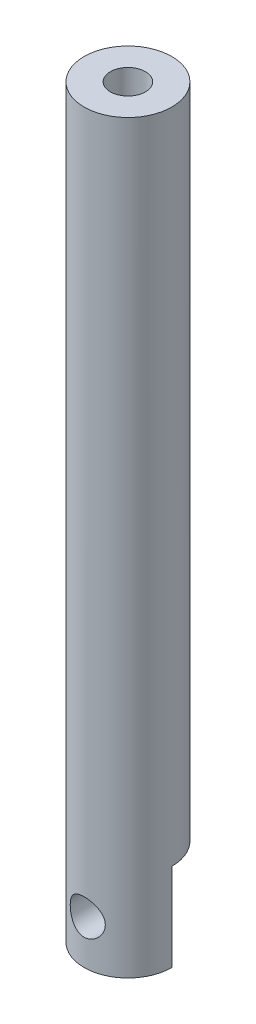
ISO-10303-21;
HEADER;
FILE_DESCRIPTION(('STEP AP214'),'2;1');
FILE_NAME('part.step','',(''),(''),'','','');
FILE_SCHEMA(('AUTOMOTIVE_DESIGN { 1 0 10303 214 1 1 1 1 }'));
ENDSEC;
DATA;
#1=APPLICATION_CONTEXT('core data for automotive mechanical design processes');
#2=APPLICATION_PROTOCOL_DEFINITION('international standard','automotive_design',2000,#1);
#3=PRODUCT_CONTEXT('',#1,'mechanical');
#4=PRODUCT('Part','Part','',(#3));
#5=PRODUCT_RELATED_PRODUCT_CATEGORY('part','',(#4));
#6=PRODUCT_DEFINITION_FORMATION('','',#4);
#7=PRODUCT_DEFINITION_CONTEXT('part definition',#1,'design');
#8=PRODUCT_DEFINITION('design','',#6,#7);
#9=PRODUCT_DEFINITION_SHAPE('','',#8);
#10=(LENGTH_UNIT() NAMED_UNIT(*) SI_UNIT(.MILLI.,.METRE.));
#11=(NAMED_UNIT(*) PLANE_ANGLE_UNIT() SI_UNIT($,.RADIAN.));
#12=(NAMED_UNIT(*) SI_UNIT($,.STERADIAN.) SOLID_ANGLE_UNIT());
#13=UNCERTAINTY_MEASURE_WITH_UNIT(LENGTH_MEASURE(1.E-05),#10,'distance_accuracy_value','');
#14=(GEOMETRIC_REPRESENTATION_CONTEXT(3) GLOBAL_UNCERTAINTY_ASSIGNED_CONTEXT((#13)) GLOBAL_UNIT_ASSIGNED_CONTEXT((#10,
#11,#12)) REPRESENTATION_CONTEXT('',''));
#15=CARTESIAN_POINT('',(0.,0.,0.));
#16=DIRECTION('',(0.,0.,1.));
#17=DIRECTION('',(1.,0.,0.));
#18=AXIS2_PLACEMENT_3D('',#15,#16,#17);
#19=CARTESIAN_POINT('',(0.,85.,0.));
#20=DIRECTION('',(0.,-1.,0.));
#21=DIRECTION('',(0.,0.,-1.));
#22=AXIS2_PLACEMENT_3D('',#19,#20,#21);
#23=CYLINDRICAL_SURFACE('',#22,5.);
#24=CARTESIAN_POINT('',(0.,3.,5.));
#25=CARTESIAN_POINT('',(-0.107493005442891,3.00000985182373,4.99999271227084));
#26=CARTESIAN_POINT('',(-0.215172564090673,3.00871775208838,4.99649294306932));
#27=CARTESIAN_POINT('',(-0.427496480417896,3.04324770352124,4.98283453100641));
#28=CARTESIAN_POINT('',(-0.532131777561248,3.06911627908613,4.97265778698877));
#29=CARTESIAN_POINT('',(-0.734953922727403,3.13687607805883,4.94674209213118));
#30=CARTESIAN_POINT('',(-0.833160661616958,3.17871484621673,4.93102136364072));
#31=CARTESIAN_POINT('',(-1.02107197032837,3.27701917332655,4.89556610796078));
#32=CARTESIAN_POINT('',(-1.11077947675099,3.33347965491893,4.87583297458056));
#33=CARTESIAN_POINT('',(-1.28350100757039,3.46223549856094,4.83330886170418));
#34=CARTESIAN_POINT('',(-1.36606227255021,3.53510665624026,4.8104229692919));
#35=CARTESIAN_POINT('',(-1.51817500478472,3.69340000347678,4.76460576906194));
#36=CARTESIAN_POINT('',(-1.58772010713353,3.77882829721174,4.74167444453792));
#37=CARTESIAN_POINT('',(-1.71487456729288,3.96442807024227,4.69722791797136));
#38=CARTESIAN_POINT('',(-1.77181498119547,4.0650864860232,4.67582115964951));
#39=CARTESIAN_POINT('',(-1.86775471903715,4.27553639842004,4.63833647186792));
#40=CARTESIAN_POINT('',(-1.90676256428583,4.38532352784836,4.62225601244176));
#41=CARTESIAN_POINT('',(-1.96389882339587,4.6057123335921,4.59826357660818));
#42=CARTESIAN_POINT('',(-1.98289396580565,4.71605123557621,4.59001420355605));
#43=CARTESIAN_POINT('',(-2.00217296164003,4.93863499830727,4.58164004049144));
#44=CARTESIAN_POINT('',(-2.00246601631322,5.05087889462501,4.58151125522768));
#45=CARTESIAN_POINT('',(-1.98498936750454,5.26575667145804,4.58910500279994));
#46=CARTESIAN_POINT('',(-1.96847531430514,5.36851571440903,4.5962817503845));
#47=CARTESIAN_POINT('',(-1.91994688029782,5.56965955600671,4.61676187607836));
#48=CARTESIAN_POINT('',(-1.88792979480463,5.66804358811031,4.63006632321673));
#49=CARTESIAN_POINT('',(-1.80869473255107,5.86001783619604,4.6615948508853));
#50=CARTESIAN_POINT('',(-1.76117986231532,5.95346923905469,4.67991379280787));
#51=CARTESIAN_POINT('',(-1.65250646073221,6.13141581636156,4.7193811638989));
#52=CARTESIAN_POINT('',(-1.59134280510084,6.21590760940281,4.74053065456848));
#53=CARTESIAN_POINT('',(-1.45155059945443,6.380409728802,4.7852673674227));
#54=CARTESIAN_POINT('',(-1.37193746297064,6.45956872944601,4.80891664976151));
#55=CARTESIAN_POINT('',(-1.20031442743019,6.60368447800204,4.85459824958282));
#56=CARTESIAN_POINT('',(-1.10830206533443,6.66863839741029,4.87663024445324));
#57=CARTESIAN_POINT('',(-0.912077652605843,6.78361744741583,4.91714681264548));
#58=CARTESIAN_POINT('',(-0.807660491346478,6.83332228119705,4.93555270095414));
#59=CARTESIAN_POINT('',(-0.591023765482882,6.91416786107806,4.96614828328759));
#60=CARTESIAN_POINT('',(-0.478808196849674,6.94531803755741,4.97834113462382));
#61=CARTESIAN_POINT('',(-0.25689588760782,6.9864482954197,4.9945613950691));
#62=CARTESIAN_POINT('',(-0.147443293985535,6.99757245425356,4.99902945833514));
#63=CARTESIAN_POINT('',(0.071845309807817,7.00171310052861,5.00068478510631));
#64=CARTESIAN_POINT('',(0.181681213223923,6.99473428154751,4.99787393582291));
#65=CARTESIAN_POINT('',(0.393432739121987,6.96370824744801,4.98557567063753));
#66=CARTESIAN_POINT('',(0.495482491775474,6.94044201964903,4.97639391345523));
#67=CARTESIAN_POINT('',(0.69413542806078,6.87856429169019,4.952594414055));
#68=CARTESIAN_POINT('',(0.790737910224844,6.83995082033132,4.9379759735653));
#69=CARTESIAN_POINT('',(0.979078785816702,6.74721506032005,4.90416594770811));
#70=CARTESIAN_POINT('',(1.07057802275541,6.69265452795685,4.88484815979803));
#71=CARTESIAN_POINT('',(1.24344359124655,6.57005967609436,4.84373364745524));
#72=CARTESIAN_POINT('',(1.32480584076112,6.50201995707739,4.8219359311027));
#73=CARTESIAN_POINT('',(1.48072304302882,6.34912998705037,4.77645117638111));
#74=CARTESIAN_POINT('',(1.55447393380606,6.26346645849379,4.75273441425052));
#75=CARTESIAN_POINT('',(1.68675119741371,6.08055991699063,4.70741672917132));
#76=CARTESIAN_POINT('',(1.74527506133751,5.98331499966005,4.68581615526511));
#77=CARTESIAN_POINT('',(1.84580750193163,5.77853830540589,4.64714299907708));
#78=CARTESIAN_POINT('',(1.88765059453445,5.67091600078769,4.63011630884788));
#79=CARTESIAN_POINT('',(1.9522962197053,5.44926634828485,4.60323673477931));
#80=CARTESIAN_POINT('',(1.97511280526932,5.33524379418758,4.59337855695998));
#81=CARTESIAN_POINT('',(1.9997156172784,5.11287209822546,4.58271759299926));
#82=CARTESIAN_POINT('',(2.00289708230287,5.00470516040665,4.58131421008171));
#83=CARTESIAN_POINT('',(1.99180315927752,4.78945514228671,4.58614836033098));
#84=CARTESIAN_POINT('',(1.97752998791378,4.68237192609742,4.59238492324793));
#85=CARTESIAN_POINT('',(1.93307136615365,4.47666781014496,4.6112664907902));
#86=CARTESIAN_POINT('',(1.90353749357098,4.377879725567,4.62364831827449));
#87=CARTESIAN_POINT('',(1.83000544849101,4.18662137038652,4.65324001232696));
#88=CARTESIAN_POINT('',(1.78600328139381,4.09415285310017,4.67045121206006));
#89=CARTESIAN_POINT('',(1.68187276275973,3.91239038072922,4.70898609604491));
#90=CARTESIAN_POINT('',(1.62096533515949,3.82358132986952,4.73048882313242));
#91=CARTESIAN_POINT('',(1.4858921192715,3.65700668279625,4.77463804372237));
#92=CARTESIAN_POINT('',(1.41172233481812,3.57924442787169,4.79728488048406));
#93=CARTESIAN_POINT('',(1.24650550627246,3.43179714673639,4.84293567087394));
#94=CARTESIAN_POINT('',(1.15467600114614,3.36296269310193,4.86586757962185));
#95=CARTESIAN_POINT('',(0.959900320285779,3.24166295737836,4.90800406713717));
#96=CARTESIAN_POINT('',(0.856949004547237,3.18920528784747,4.92720691092906));
#97=CARTESIAN_POINT('',(0.644738062495204,3.10337778480971,4.95939714815861));
#98=CARTESIAN_POINT('',(0.535631618219697,3.06967067643966,4.97249363055028));
#99=CARTESIAN_POINT('',(0.312876546281222,3.02136087904573,4.99144306209365));
#100=CARTESIAN_POINT('',(0.199243525858913,3.0066975632561,4.99731899495637));
#101=CARTESIAN_POINT('',(0.0569122978909298,3.00060461902173,4.99975899504136));
#102=CARTESIAN_POINT('',(0.0284626887407584,2.99999739137081,5.00000192969175));
#103=CARTESIAN_POINT('',(0.,3.,5.));
#104=B_SPLINE_CURVE_WITH_KNOTS('',3,(#24,#25,#26,#27,#28,#29,#30,#31,#32,#33,#34,#35,#36,#37,
#38,#39,#40,#41,#42,#43,#44,#45,#46,#47,#48,#49,#50,#51,#52,#53,#54,#55,#56,#57,#58,#59,#60,#61,
#62,#63,#64,#65,#66,#67,#68,#69,#70,#71,#72,#73,#74,#75,#76,#77,#78,#79,#80,#81,#82,#83,#84,#85,
#86,#87,#88,#89,#90,#91,#92,#93,#94,#95,#96,#97,#98,#99,#100,#101,#102,#103),.UNSPECIFIED.,.T.,
.F.,(4,2,2,2,2,2,2,2,2,2,2,2,2,2,2,2,2,2,2,2,2,2,2,2,2,2,2,2,2,2,2,2,2,2,2,2,2,2,2,4),(0.,
0.322402987893071,0.645683636007934,0.967911457471581,1.29002753567984,1.62597381700397,
1.96208394934411,2.31315258819217,2.66405423118268,2.99904105308828,3.33386306340488,
3.64538328401372,3.95695787256047,4.27489126298816,4.59294421938183,4.93558349186557,
5.27829092839732,5.62776913162806,5.9770695611379,6.30569184528007,6.63422893570082,
6.94800455564365,7.26182048993796,7.58523513398262,7.90877959498969,8.25368474624413,
8.59864669043748,8.94695045140827,9.29499672645933,9.61799673392748,9.94095572563045,
10.2511431854877,10.5614163580516,10.8894546805669,11.2175920134839,11.5670042353384,
11.9165786364053,12.2596430101332,12.6016125240434,12.686980458968),.UNSPECIFIED.);
#105=CARTESIAN_POINT('',(0.,3.,5.));
#106=VERTEX_POINT('',#105);
#107=EDGE_CURVE('E72',#106,#106,#104,.T.);
#108=ORIENTED_EDGE('',*,*,#107,.T.);
#109=EDGE_LOOP('',(#108));
#110=FACE_BOUND('',#109,.T.);
#111=CARTESIAN_POINT('',(0.,85.,0.));
#112=DIRECTION('',(0.,1.,0.));
#113=DIRECTION('',(0.,0.,1.));
#114=AXIS2_PLACEMENT_3D('',#111,#112,#113);
#115=CIRCLE('',#114,5.);
#116=CARTESIAN_POINT('',(0.,85.,5.));
#117=VERTEX_POINT('',#116);
#118=EDGE_CURVE('E11',#117,#117,#115,.T.);
#119=ORIENTED_EDGE('',*,*,#118,.F.);
#120=EDGE_LOOP('',(#119));
#121=FACE_BOUND('',#120,.T.);
#122=CARTESIAN_POINT('',(0.,10.,0.));
#123=DIRECTION('',(0.,-1.,0.));
#124=DIRECTION('',(0.,0.,1.));
#125=AXIS2_PLACEMENT_3D('',#122,#123,#124);
#126=CIRCLE('',#125,5.);
#127=CARTESIAN_POINT('',(-5.,10.,0.));
#128=VERTEX_POINT('',#127);
#129=CARTESIAN_POINT('',(5.,10.,0.));
#130=VERTEX_POINT('',#129);
#131=EDGE_CURVE('E71',#128,#130,#126,.T.);
#132=ORIENTED_EDGE('',*,*,#131,.F.);
#133=DIRECTION('',(0.,-1.,0.));
#134=VECTOR('',#133,1.);
#135=CARTESIAN_POINT('',(-5.,10.,0.));
#136=LINE('',#135,#134);
#137=CARTESIAN_POINT('',(-5.,0.,0.));
#138=VERTEX_POINT('',#137);
#139=EDGE_CURVE('E60',#128,#138,#136,.T.);
#140=ORIENTED_EDGE('',*,*,#139,.T.);
#141=CARTESIAN_POINT('',(0.,0.,0.));
#142=DIRECTION('',(0.,1.,0.));
#143=DIRECTION('',(0.,0.,1.));
#144=AXIS2_PLACEMENT_3D('',#141,#142,#143);
#145=CIRCLE('',#144,5.);
#146=CARTESIAN_POINT('',(5.,0.,0.));
#147=VERTEX_POINT('',#146);
#148=EDGE_CURVE('E42',#138,#147,#145,.T.);
#149=ORIENTED_EDGE('',*,*,#148,.T.);
#150=DIRECTION('',(0.,-1.,0.));
#151=VECTOR('',#150,1.);
#152=CARTESIAN_POINT('',(5.,10.,0.));
#153=LINE('',#152,#151);
#154=EDGE_CURVE('E54',#130,#147,#153,.T.);
#155=ORIENTED_EDGE('',*,*,#154,.F.);
#156=EDGE_LOOP('',(#132,#140,#149,#155));
#157=FACE_BOUND('',#156,.T.);
#158=ADVANCED_FACE('F38',(#110,#121,#157),#23,.T.);
#159=CARTESIAN_POINT('',(0.,85.,0.));
#160=DIRECTION('',(0.,1.,0.));
#161=DIRECTION('',(0.,0.,1.));
#162=AXIS2_PLACEMENT_3D('',#159,#160,#161);
#163=PLANE('',#162);
#164=CARTESIAN_POINT('',(0.,85.,0.));
#165=DIRECTION('',(0.,1.,0.));
#166=DIRECTION('',(0.,0.,1.));
#167=AXIS2_PLACEMENT_3D('',#164,#165,#166);
#168=CIRCLE('',#167,2.);
#169=CARTESIAN_POINT('',(0.,85.,2.));
#170=VERTEX_POINT('',#169);
#171=EDGE_CURVE('E77',#170,#170,#168,.T.);
#172=ORIENTED_EDGE('',*,*,#171,.F.);
#173=EDGE_LOOP('',(#172));
#174=FACE_BOUND('',#173,.T.);
#175=ORIENTED_EDGE('',*,*,#118,.T.);
#176=EDGE_LOOP('',(#175));
#177=FACE_BOUND('',#176,.T.);
#178=ADVANCED_FACE('F125',(#174,#177),#163,.T.);
#179=CARTESIAN_POINT('',(0.,0.,0.));
#180=DIRECTION('',(0.,1.,0.));
#181=DIRECTION('',(0.,0.,1.));
#182=AXIS2_PLACEMENT_3D('',#179,#180,#181);
#183=PLANE('',#182);
#184=ORIENTED_EDGE('',*,*,#148,.F.);
#185=DIRECTION('',(-1.,0.,0.));
#186=VECTOR('',#185,1.);
#187=CARTESIAN_POINT('',(5.,0.,0.));
#188=LINE('',#187,#186);
#189=EDGE_CURVE('E65',#147,#138,#188,.T.);
#190=ORIENTED_EDGE('',*,*,#189,.F.);
#191=EDGE_LOOP('',(#184,#190));
#192=FACE_BOUND('',#191,.T.);
#193=ADVANCED_FACE('F79',(#192),#183,.F.);
#194=CARTESIAN_POINT('',(0.,70.,0.));
#195=DIRECTION('',(0.,1.,0.));
#196=DIRECTION('',(0.,0.,1.));
#197=AXIS2_PLACEMENT_3D('',#194,#195,#196);
#198=CYLINDRICAL_SURFACE('',#197,2.);
#199=CARTESIAN_POINT('',(0.,70.,0.));
#200=DIRECTION('',(0.,1.,0.));
#201=DIRECTION('',(0.,0.,1.));
#202=AXIS2_PLACEMENT_3D('',#199,#200,#201);
#203=CIRCLE('',#202,2.);
#204=CARTESIAN_POINT('',(0.,70.,2.));
#205=VERTEX_POINT('',#204);
#206=EDGE_CURVE('E81',#205,#205,#203,.T.);
#207=ORIENTED_EDGE('',*,*,#206,.F.);
#208=EDGE_LOOP('',(#207));
#209=FACE_BOUND('',#208,.T.);
#210=ORIENTED_EDGE('',*,*,#171,.T.);
#211=EDGE_LOOP('',(#210));
#212=FACE_BOUND('',#211,.T.);
#213=ADVANCED_FACE('F121',(#209,#212),#198,.F.);
#214=CARTESIAN_POINT('',(0.,70.,0.));
#215=DIRECTION('',(0.,1.,0.));
#216=DIRECTION('',(0.,0.,1.));
#217=AXIS2_PLACEMENT_3D('',#214,#215,#216);
#218=PLANE('',#217);
#219=ORIENTED_EDGE('',*,*,#206,.T.);
#220=EDGE_LOOP('',(#219));
#221=FACE_BOUND('',#220,.T.);
#222=ADVANCED_FACE('F117',(#221),#218,.T.);
#223=CARTESIAN_POINT('',(5.,10.,0.));
#224=DIRECTION('',(0.,0.,1.));
#225=DIRECTION('',(1.,0.,0.));
#226=AXIS2_PLACEMENT_3D('',#223,#224,#225);
#227=PLANE('',#226);
#228=CARTESIAN_POINT('',(0.,5.,0.));
#229=DIRECTION('',(0.,0.,-1.));
#230=DIRECTION('',(-1.,0.,0.));
#231=AXIS2_PLACEMENT_3D('',#228,#229,#230);
#232=CIRCLE('',#231,2.);
#233=CARTESIAN_POINT('',(-2.,5.,0.));
#234=VERTEX_POINT('',#233);
#235=EDGE_CURVE('E105',#234,#234,#232,.T.);
#236=ORIENTED_EDGE('',*,*,#235,.F.);
#237=EDGE_LOOP('',(#236));
#238=FACE_BOUND('',#237,.T.);
#239=ORIENTED_EDGE('',*,*,#189,.T.);
#240=ORIENTED_EDGE('',*,*,#139,.F.);
#241=DIRECTION('',(-1.,0.,0.));
#242=VECTOR('',#241,1.);
#243=CARTESIAN_POINT('',(5.,10.,0.));
#244=LINE('',#243,#242);
#245=EDGE_CURVE('E92',#130,#128,#244,.T.);
#246=ORIENTED_EDGE('',*,*,#245,.F.);
#247=ORIENTED_EDGE('',*,*,#154,.T.);
#248=EDGE_LOOP('',(#239,#240,#246,#247));
#249=FACE_BOUND('',#248,.T.);
#250=ADVANCED_FACE('F66',(#238,#249),#227,.F.);
#251=CARTESIAN_POINT('',(0.,10.,0.));
#252=DIRECTION('',(0.,1.,0.));
#253=DIRECTION('',(0.,0.,1.));
#254=AXIS2_PLACEMENT_3D('',#251,#252,#253);
#255=PLANE('',#254);
#256=ORIENTED_EDGE('',*,*,#131,.T.);
#257=ORIENTED_EDGE('',*,*,#245,.T.);
#258=EDGE_LOOP('',(#256,#257));
#259=FACE_BOUND('',#258,.T.);
#260=ADVANCED_FACE('F110',(#259),#255,.F.);
#261=CARTESIAN_POINT('',(0.,5.,5.));
#262=DIRECTION('',(0.,0.,-1.));
#263=DIRECTION('',(-1.,0.,0.));
#264=AXIS2_PLACEMENT_3D('',#261,#262,#263);
#265=CYLINDRICAL_SURFACE('',#264,2.);
#266=ORIENTED_EDGE('',*,*,#235,.T.);
#267=EDGE_LOOP('',(#266));
#268=FACE_BOUND('',#267,.T.);
#269=ORIENTED_EDGE('',*,*,#107,.F.);
#270=EDGE_LOOP('',(#269));
#271=FACE_BOUND('',#270,.T.);
#272=ADVANCED_FACE('F106',(#268,#271),#265,.F.);
#273=CLOSED_SHELL('',(#158,#178,#193,#213,#222,#250,#260,#272));
#274=MANIFOLD_SOLID_BREP('B2',#273);
#275=ADVANCED_BREP_SHAPE_REPRESENTATION('',(#18,#274),#14);
#276=SHAPE_DEFINITION_REPRESENTATION(#9,#275);
ENDSEC;
END-ISO-10303-21;
